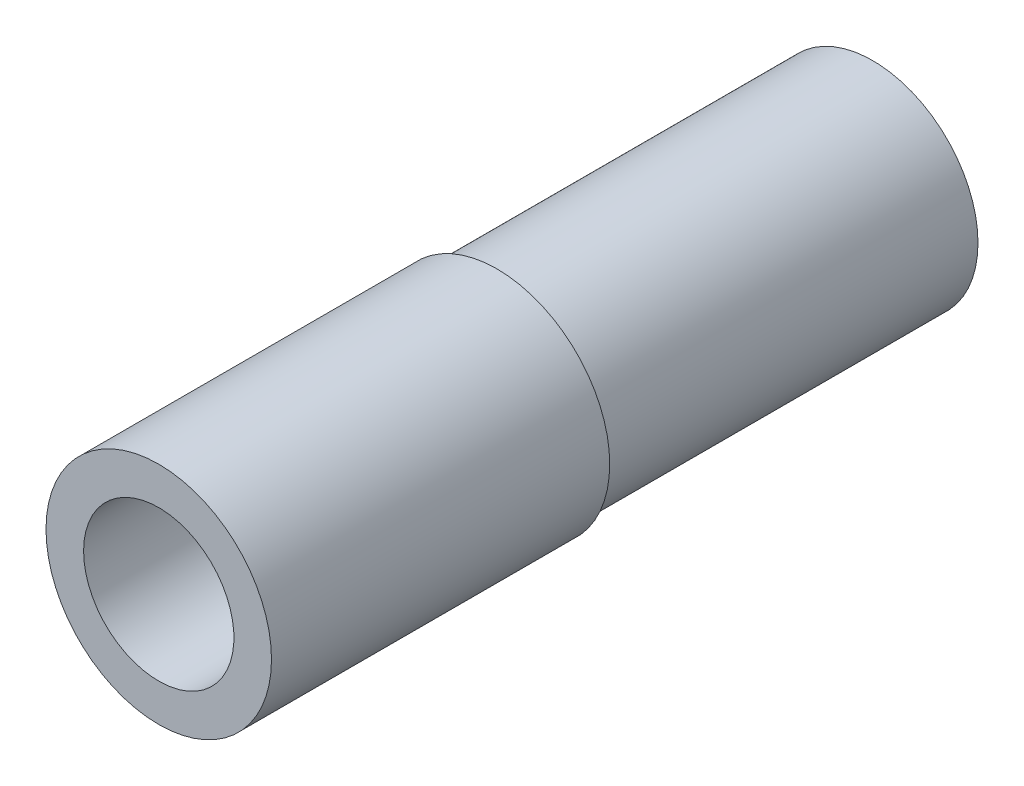
ISO-10303-21;
HEADER;
FILE_DESCRIPTION(('STEP AP214'),'2;1');
FILE_NAME('part.step','',(''),(''),'','','');
FILE_SCHEMA(('AUTOMOTIVE_DESIGN { 1 0 10303 214 1 1 1 1 }'));
ENDSEC;
DATA;
#1=APPLICATION_CONTEXT('core data for automotive mechanical design processes');
#2=APPLICATION_PROTOCOL_DEFINITION('international standard','automotive_design',2000,#1);
#3=PRODUCT_CONTEXT('',#1,'mechanical');
#4=PRODUCT('Part','Part','',(#3));
#5=PRODUCT_RELATED_PRODUCT_CATEGORY('part','',(#4));
#6=PRODUCT_DEFINITION_FORMATION('','',#4);
#7=PRODUCT_DEFINITION_CONTEXT('part definition',#1,'design');
#8=PRODUCT_DEFINITION('design','',#6,#7);
#9=PRODUCT_DEFINITION_SHAPE('','',#8);
#10=(LENGTH_UNIT() NAMED_UNIT(*) SI_UNIT(.MILLI.,.METRE.));
#11=(NAMED_UNIT(*) PLANE_ANGLE_UNIT() SI_UNIT($,.RADIAN.));
#12=(NAMED_UNIT(*) SI_UNIT($,.STERADIAN.) SOLID_ANGLE_UNIT());
#13=UNCERTAINTY_MEASURE_WITH_UNIT(LENGTH_MEASURE(1.E-05),#10,'distance_accuracy_value','');
#14=(GEOMETRIC_REPRESENTATION_CONTEXT(3) GLOBAL_UNCERTAINTY_ASSIGNED_CONTEXT((#13)) GLOBAL_UNIT_ASSIGNED_CONTEXT((#10,
#11,#12)) REPRESENTATION_CONTEXT('',''));
#15=CARTESIAN_POINT('',(0.,0.,0.));
#16=DIRECTION('',(0.,0.,1.));
#17=DIRECTION('',(1.,0.,0.));
#18=AXIS2_PLACEMENT_3D('',#15,#16,#17);
#19=CARTESIAN_POINT('',(0.,0.,45.));
#20=DIRECTION('',(0.,0.,-1.));
#21=DIRECTION('',(-1.,0.,0.));
#22=AXIS2_PLACEMENT_3D('',#19,#20,#21);
#23=CYLINDRICAL_SURFACE('',#22,15.);
#24=CARTESIAN_POINT('',(0.,0.,45.));
#25=DIRECTION('',(0.,0.,1.));
#26=DIRECTION('',(1.,0.,0.));
#27=AXIS2_PLACEMENT_3D('',#24,#25,#26);
#28=CIRCLE('',#27,15.);
#29=CARTESIAN_POINT('',(15.,0.,45.));
#30=VERTEX_POINT('',#29);
#31=EDGE_CURVE('E49',#30,#30,#28,.T.);
#32=ORIENTED_EDGE('',*,*,#31,.F.);
#33=EDGE_LOOP('',(#32));
#34=FACE_BOUND('',#33,.T.);
#35=CARTESIAN_POINT('',(0.,0.,0.));
#36=DIRECTION('',(0.,0.,1.));
#37=DIRECTION('',(1.,0.,0.));
#38=AXIS2_PLACEMENT_3D('',#35,#36,#37);
#39=CIRCLE('',#38,15.);
#40=CARTESIAN_POINT('',(15.,0.,0.));
#41=VERTEX_POINT('',#40);
#42=EDGE_CURVE('E44',#41,#41,#39,.T.);
#43=ORIENTED_EDGE('',*,*,#42,.T.);
#44=EDGE_LOOP('',(#43));
#45=FACE_BOUND('',#44,.T.);
#46=ADVANCED_FACE('F41',(#34,#45),#23,.T.);
#47=CARTESIAN_POINT('',(0.,0.,45.));
#48=DIRECTION('',(0.,0.,1.));
#49=DIRECTION('',(1.,0.,0.));
#50=AXIS2_PLACEMENT_3D('',#47,#48,#49);
#51=PLANE('',#50);
#52=CARTESIAN_POINT('',(0.,0.,45.));
#53=DIRECTION('',(0.,0.,-1.));
#54=DIRECTION('',(-1.,0.,0.));
#55=AXIS2_PLACEMENT_3D('',#52,#53,#54);
#56=CIRCLE('',#55,10.);
#57=CARTESIAN_POINT('',(-10.,0.,45.));
#58=VERTEX_POINT('',#57);
#59=EDGE_CURVE('E59',#58,#58,#56,.T.);
#60=ORIENTED_EDGE('',*,*,#59,.T.);
#61=EDGE_LOOP('',(#60));
#62=FACE_BOUND('',#61,.T.);
#63=ORIENTED_EDGE('',*,*,#31,.T.);
#64=EDGE_LOOP('',(#63));
#65=FACE_BOUND('',#64,.T.);
#66=ADVANCED_FACE('F103',(#62,#65),#51,.T.);
#67=CARTESIAN_POINT('',(0.,0.,0.));
#68=DIRECTION('',(0.,0.,1.));
#69=DIRECTION('',(1.,0.,0.));
#70=AXIS2_PLACEMENT_3D('',#67,#68,#69);
#71=PLANE('',#70);
#72=CARTESIAN_POINT('',(0.,0.,0.));
#73=DIRECTION('',(0.,0.,-1.));
#74=DIRECTION('',(-1.,0.,0.));
#75=AXIS2_PLACEMENT_3D('',#72,#73,#74);
#76=CIRCLE('',#75,14.);
#77=CARTESIAN_POINT('',(-14.,0.,0.));
#78=VERTEX_POINT('',#77);
#79=EDGE_CURVE('E10',#78,#78,#76,.T.);
#80=ORIENTED_EDGE('',*,*,#79,.F.);
#81=EDGE_LOOP('',(#80));
#82=FACE_BOUND('',#81,.T.);
#83=ORIENTED_EDGE('',*,*,#42,.F.);
#84=EDGE_LOOP('',(#83));
#85=FACE_BOUND('',#84,.T.);
#86=ADVANCED_FACE('F97',(#82,#85),#71,.F.);
#87=CARTESIAN_POINT('',(0.,0.,45.));
#88=DIRECTION('',(0.,0.,-1.));
#89=DIRECTION('',(-1.,0.,0.));
#90=AXIS2_PLACEMENT_3D('',#87,#88,#89);
#91=CYLINDRICAL_SURFACE('',#90,10.);
#92=ORIENTED_EDGE('',*,*,#59,.F.);
#93=EDGE_LOOP('',(#92));
#94=FACE_BOUND('',#93,.T.);
#95=CARTESIAN_POINT('',(0.,0.,0.));
#96=DIRECTION('',(0.,0.,-1.));
#97=DIRECTION('',(-1.,0.,0.));
#98=AXIS2_PLACEMENT_3D('',#95,#96,#97);
#99=CIRCLE('',#98,10.);
#100=CARTESIAN_POINT('',(-10.,0.,0.));
#101=VERTEX_POINT('',#100);
#102=EDGE_CURVE('E63',#101,#101,#99,.T.);
#103=ORIENTED_EDGE('',*,*,#102,.T.);
#104=EDGE_LOOP('',(#103));
#105=FACE_BOUND('',#104,.T.);
#106=ADVANCED_FACE('F88',(#94,#105),#91,.F.);
#107=CARTESIAN_POINT('',(0.,0.,-50.));
#108=DIRECTION('',(0.,0.,-1.));
#109=DIRECTION('',(-1.,0.,0.));
#110=AXIS2_PLACEMENT_3D('',#107,#108,#109);
#111=PLANE('',#110);
#112=CARTESIAN_POINT('',(0.,0.,-50.));
#113=DIRECTION('',(0.,0.,-1.));
#114=DIRECTION('',(-1.,0.,0.));
#115=AXIS2_PLACEMENT_3D('',#112,#113,#114);
#116=CIRCLE('',#115,10.);
#117=CARTESIAN_POINT('',(-10.,0.,-50.));
#118=VERTEX_POINT('',#117);
#119=EDGE_CURVE('E75',#118,#118,#116,.T.);
#120=ORIENTED_EDGE('',*,*,#119,.F.);
#121=EDGE_LOOP('',(#120));
#122=FACE_BOUND('',#121,.T.);
#123=CARTESIAN_POINT('',(0.,0.,-50.));
#124=DIRECTION('',(0.,0.,-1.));
#125=DIRECTION('',(-1.,0.,0.));
#126=AXIS2_PLACEMENT_3D('',#123,#124,#125);
#127=CIRCLE('',#126,14.);
#128=CARTESIAN_POINT('',(-14.,0.,-50.));
#129=VERTEX_POINT('',#128);
#130=EDGE_CURVE('E57',#129,#129,#127,.T.);
#131=ORIENTED_EDGE('',*,*,#130,.T.);
#132=EDGE_LOOP('',(#131));
#133=FACE_BOUND('',#132,.T.);
#134=ADVANCED_FACE('F85',(#122,#133),#111,.T.);
#135=CARTESIAN_POINT('',(0.,0.,-50.));
#136=DIRECTION('',(0.,0.,1.));
#137=DIRECTION('',(1.,0.,0.));
#138=AXIS2_PLACEMENT_3D('',#135,#136,#137);
#139=CYLINDRICAL_SURFACE('',#138,14.);
#140=ORIENTED_EDGE('',*,*,#130,.F.);
#141=EDGE_LOOP('',(#140));
#142=FACE_BOUND('',#141,.T.);
#143=ORIENTED_EDGE('',*,*,#79,.T.);
#144=EDGE_LOOP('',(#143));
#145=FACE_BOUND('',#144,.T.);
#146=ADVANCED_FACE('F87',(#142,#145),#139,.T.);
#147=CARTESIAN_POINT('',(0.,0.,0.));
#148=DIRECTION('',(0.,0.,-1.));
#149=DIRECTION('',(-1.,0.,0.));
#150=AXIS2_PLACEMENT_3D('',#147,#148,#149);
#151=PLANE('',#150);
#152=ORIENTED_EDGE('',*,*,#102,.F.);
#153=EDGE_LOOP('',(#152));
#154=FACE_BOUND('',#153,.T.);
#155=ADVANCED_FACE('F94',(#154),#151,.F.);
#156=CARTESIAN_POINT('',(0.,0.,-32.));
#157=DIRECTION('',(0.,0.,-1.));
#158=DIRECTION('',(-1.,0.,0.));
#159=AXIS2_PLACEMENT_3D('',#156,#157,#158);
#160=CYLINDRICAL_SURFACE('',#159,10.);
#161=CARTESIAN_POINT('',(0.,0.,-32.));
#162=DIRECTION('',(0.,0.,-1.));
#163=DIRECTION('',(-1.,0.,0.));
#164=AXIS2_PLACEMENT_3D('',#161,#162,#163);
#165=CIRCLE('',#164,10.);
#166=CARTESIAN_POINT('',(-10.,0.,-32.));
#167=VERTEX_POINT('',#166);
#168=EDGE_CURVE('E70',#167,#167,#165,.T.);
#169=ORIENTED_EDGE('',*,*,#168,.F.);
#170=EDGE_LOOP('',(#169));
#171=FACE_BOUND('',#170,.T.);
#172=ORIENTED_EDGE('',*,*,#119,.T.);
#173=EDGE_LOOP('',(#172));
#174=FACE_BOUND('',#173,.T.);
#175=ADVANCED_FACE('F83',(#171,#174),#160,.F.);
#176=CARTESIAN_POINT('',(0.,0.,-32.));
#177=DIRECTION('',(0.,0.,-1.));
#178=DIRECTION('',(-1.,0.,0.));
#179=AXIS2_PLACEMENT_3D('',#176,#177,#178);
#180=PLANE('',#179);
#181=ORIENTED_EDGE('',*,*,#168,.T.);
#182=EDGE_LOOP('',(#181));
#183=FACE_BOUND('',#182,.T.);
#184=ADVANCED_FACE('F125',(#183),#180,.T.);
#185=CLOSED_SHELL('',(#46,#66,#86,#106,#134,#146,#155,#175,#184));
#186=MANIFOLD_SOLID_BREP('B2',#185);
#187=ADVANCED_BREP_SHAPE_REPRESENTATION('',(#18,#186),#14);
#188=SHAPE_DEFINITION_REPRESENTATION(#9,#187);
ENDSEC;
END-ISO-10303-21;
